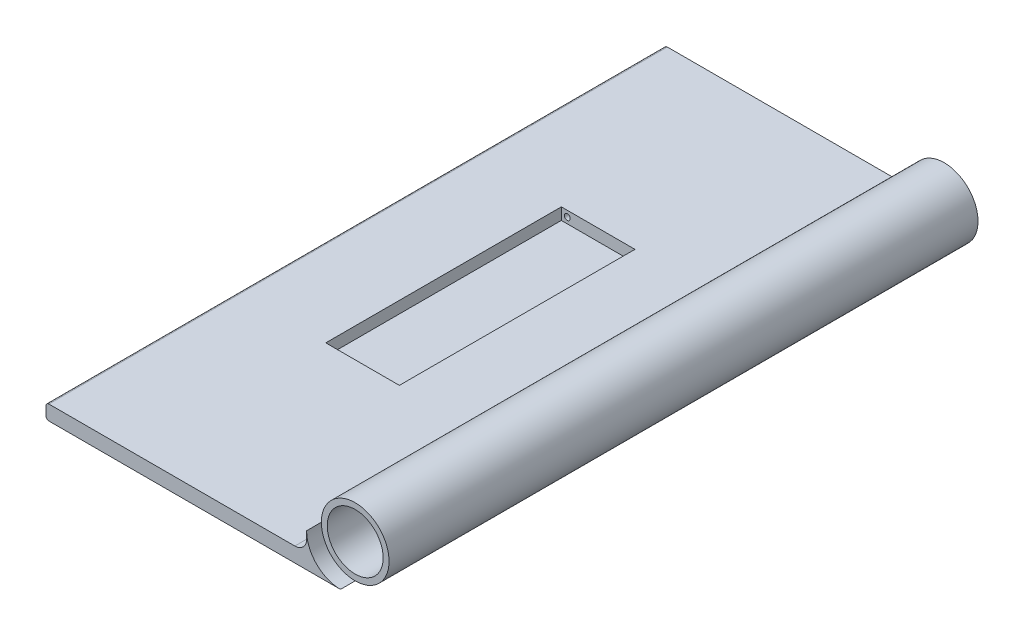
ISO-10303-21;
HEADER;
FILE_DESCRIPTION(('STEP AP214'),'2;1');
FILE_NAME('part.step','',(''),(''),'','','');
FILE_SCHEMA(('AUTOMOTIVE_DESIGN { 1 0 10303 214 1 1 1 1 }'));
ENDSEC;
DATA;
#1=APPLICATION_CONTEXT('core data for automotive mechanical design processes');
#2=APPLICATION_PROTOCOL_DEFINITION('international standard','automotive_design',2000,#1);
#3=PRODUCT_CONTEXT('',#1,'mechanical');
#4=PRODUCT('Part','Part','',(#3));
#5=PRODUCT_RELATED_PRODUCT_CATEGORY('part','',(#4));
#6=PRODUCT_DEFINITION_FORMATION('','',#4);
#7=PRODUCT_DEFINITION_CONTEXT('part definition',#1,'design');
#8=PRODUCT_DEFINITION('design','',#6,#7);
#9=PRODUCT_DEFINITION_SHAPE('','',#8);
#10=(LENGTH_UNIT() NAMED_UNIT(*) SI_UNIT(.MILLI.,.METRE.));
#11=(NAMED_UNIT(*) PLANE_ANGLE_UNIT() SI_UNIT($,.RADIAN.));
#12=(NAMED_UNIT(*) SI_UNIT($,.STERADIAN.) SOLID_ANGLE_UNIT());
#13=UNCERTAINTY_MEASURE_WITH_UNIT(LENGTH_MEASURE(1.E-05),#10,'distance_accuracy_value','');
#14=(GEOMETRIC_REPRESENTATION_CONTEXT(3) GLOBAL_UNCERTAINTY_ASSIGNED_CONTEXT((#13)) GLOBAL_UNIT_ASSIGNED_CONTEXT((#10,
#11,#12)) REPRESENTATION_CONTEXT('',''));
#15=CARTESIAN_POINT('',(0.,0.,0.));
#16=DIRECTION('',(0.,0.,1.));
#17=DIRECTION('',(1.,0.,0.));
#18=AXIS2_PLACEMENT_3D('',#15,#16,#17);
#19=CARTESIAN_POINT('',(0.,0.,200.));
#20=DIRECTION('',(0.,0.,1.));
#21=DIRECTION('',(1.,0.,0.));
#22=AXIS2_PLACEMENT_3D('',#19,#20,#21);
#23=PLANE('',#22);
#24=CARTESIAN_POINT('',(0.,0.,200.));
#25=DIRECTION('',(0.,0.,1.));
#26=DIRECTION('',(1.,0.,0.));
#27=AXIS2_PLACEMENT_3D('',#24,#25,#26);
#28=CIRCLE('',#27,9.5);
#29=CARTESIAN_POINT('',(9.5,0.,200.));
#30=VERTEX_POINT('',#29);
#31=EDGE_CURVE('E236',#30,#30,#28,.T.);
#32=ORIENTED_EDGE('',*,*,#31,.F.);
#33=EDGE_LOOP('',(#32));
#34=FACE_BOUND('',#33,.T.);
#35=CARTESIAN_POINT('',(0.,0.,200.));
#36=DIRECTION('',(0.,0.,1.));
#37=DIRECTION('',(1.,0.,0.));
#38=AXIS2_PLACEMENT_3D('',#35,#36,#37);
#39=CIRCLE('',#38,11.5);
#40=CARTESIAN_POINT('',(0.,-11.5,200.));
#41=VERTEX_POINT('',#40);
#42=CARTESIAN_POINT('',(-11.5,0.,200.));
#43=VERTEX_POINT('',#42);
#44=EDGE_CURVE('E233',#41,#43,#39,.T.);
#45=ORIENTED_EDGE('',*,*,#44,.T.);
#46=CARTESIAN_POINT('',(0.,0.,200.));
#47=DIRECTION('',(0.,0.,1.));
#48=DIRECTION('',(1.,0.,0.));
#49=AXIS2_PLACEMENT_3D('',#46,#47,#48);
#50=CIRCLE('',#49,11.5);
#51=EDGE_CURVE('E226',#43,#41,#50,.T.);
#52=ORIENTED_EDGE('',*,*,#51,.T.);
#53=EDGE_LOOP('',(#45,#52));
#54=FACE_BOUND('',#53,.T.);
#55=ADVANCED_FACE('F33',(#34,#54),#23,.T.);
#56=CARTESIAN_POINT('',(0.,0.,0.));
#57=DIRECTION('',(0.,0.,1.));
#58=DIRECTION('',(1.,0.,0.));
#59=AXIS2_PLACEMENT_3D('',#56,#57,#58);
#60=PLANE('',#59);
#61=CARTESIAN_POINT('',(0.,0.,0.));
#62=DIRECTION('',(0.,0.,1.));
#63=DIRECTION('',(1.,0.,0.));
#64=AXIS2_PLACEMENT_3D('',#61,#62,#63);
#65=CIRCLE('',#64,9.5);
#66=CARTESIAN_POINT('',(9.5,0.,0.));
#67=VERTEX_POINT('',#66);
#68=EDGE_CURVE('E237',#67,#67,#65,.T.);
#69=ORIENTED_EDGE('',*,*,#68,.T.);
#70=EDGE_LOOP('',(#69));
#71=FACE_BOUND('',#70,.T.);
#72=CARTESIAN_POINT('',(0.,0.,0.));
#73=DIRECTION('',(0.,0.,1.));
#74=DIRECTION('',(1.,0.,0.));
#75=AXIS2_PLACEMENT_3D('',#72,#73,#74);
#76=CIRCLE('',#75,11.5);
#77=CARTESIAN_POINT('',(-11.5,0.,0.));
#78=VERTEX_POINT('',#77);
#79=CARTESIAN_POINT('',(0.,-11.5,0.));
#80=VERTEX_POINT('',#79);
#81=EDGE_CURVE('E11',#78,#80,#76,.T.);
#82=ORIENTED_EDGE('',*,*,#81,.F.);
#83=CARTESIAN_POINT('',(0.,0.,0.));
#84=DIRECTION('',(0.,0.,1.));
#85=DIRECTION('',(1.,0.,0.));
#86=AXIS2_PLACEMENT_3D('',#83,#84,#85);
#87=CIRCLE('',#86,11.5);
#88=EDGE_CURVE('E232',#80,#78,#87,.T.);
#89=ORIENTED_EDGE('',*,*,#88,.F.);
#90=EDGE_LOOP('',(#82,#89));
#91=FACE_BOUND('',#90,.T.);
#92=ADVANCED_FACE('F304',(#71,#91),#60,.F.);
#93=CARTESIAN_POINT('',(0.,-6.5,200.));
#94=DIRECTION('',(0.,-1.,0.));
#95=DIRECTION('',(1.,0.,0.));
#96=AXIS2_PLACEMENT_3D('',#93,#94,#95);
#97=PLANE('',#96);
#98=DIRECTION('',(1.,0.,0.));
#99=VECTOR('',#98,1.);
#100=CARTESIAN_POINT('',(-70.,-6.50000000000001,140.));
#101=LINE('',#100,#99);
#102=CARTESIAN_POINT('',(-70.,-6.50000000000001,140.));
#103=VERTEX_POINT('',#102);
#104=CARTESIAN_POINT('',(-45.,-6.50000000000001,140.));
#105=VERTEX_POINT('',#104);
#106=EDGE_CURVE('E166',#103,#105,#101,.T.);
#107=ORIENTED_EDGE('',*,*,#106,.F.);
#108=DIRECTION('',(0.,0.,1.));
#109=VECTOR('',#108,1.);
#110=CARTESIAN_POINT('',(-70.,-6.50000000000001,60.));
#111=LINE('',#110,#109);
#112=CARTESIAN_POINT('',(-70.,-6.50000000000001,60.));
#113=VERTEX_POINT('',#112);
#114=EDGE_CURVE('E49',#113,#103,#111,.T.);
#115=ORIENTED_EDGE('',*,*,#114,.F.);
#116=DIRECTION('',(-1.,0.,0.));
#117=VECTOR('',#116,1.);
#118=CARTESIAN_POINT('',(-70.,-6.50000000000001,60.));
#119=LINE('',#118,#117);
#120=CARTESIAN_POINT('',(-45.,-6.50000000000001,60.));
#121=VERTEX_POINT('',#120);
#122=EDGE_CURVE('E154',#121,#113,#119,.T.);
#123=ORIENTED_EDGE('',*,*,#122,.F.);
#124=DIRECTION('',(0.,0.,-1.));
#125=VECTOR('',#124,1.);
#126=CARTESIAN_POINT('',(-45.,-6.50000000000001,60.));
#127=LINE('',#126,#125);
#128=EDGE_CURVE('E157',#105,#121,#127,.T.);
#129=ORIENTED_EDGE('',*,*,#128,.F.);
#130=EDGE_LOOP('',(#107,#115,#123,#129));
#131=FACE_BOUND('',#130,.T.);
#132=DIRECTION('',(0.,0.,-1.));
#133=VECTOR('',#132,1.);
#134=CARTESIAN_POINT('',(-15.5,-6.5,200.));
#135=LINE('',#134,#133);
#136=CARTESIAN_POINT('',(-15.5,-6.5,205.));
#137=VERTEX_POINT('',#136);
#138=CARTESIAN_POINT('',(-15.5,-6.5,-5.));
#139=VERTEX_POINT('',#138);
#140=EDGE_CURVE('E240',#137,#139,#135,.T.);
#141=ORIENTED_EDGE('',*,*,#140,.T.);
#142=DIRECTION('',(1.,0.,0.));
#143=VECTOR('',#142,1.);
#144=CARTESIAN_POINT('',(0.,-6.5,-5.));
#145=LINE('',#144,#143);
#146=CARTESIAN_POINT('',(-99.,-6.50000000000001,-5.));
#147=VERTEX_POINT('',#146);
#148=EDGE_CURVE('E190',#147,#139,#145,.T.);
#149=ORIENTED_EDGE('',*,*,#148,.F.);
#150=DIRECTION('',(0.,0.,-1.));
#151=VECTOR('',#150,1.);
#152=CARTESIAN_POINT('',(-99.,-6.50000000000001,200.));
#153=LINE('',#152,#151);
#154=CARTESIAN_POINT('',(-99.,-6.50000000000001,205.));
#155=VERTEX_POINT('',#154);
#156=EDGE_CURVE('E42',#155,#147,#153,.T.);
#157=ORIENTED_EDGE('',*,*,#156,.F.);
#158=DIRECTION('',(1.,0.,0.));
#159=VECTOR('',#158,1.);
#160=CARTESIAN_POINT('',(0.,-6.5,205.));
#161=LINE('',#160,#159);
#162=EDGE_CURVE('E213',#155,#137,#161,.T.);
#163=ORIENTED_EDGE('',*,*,#162,.T.);
#164=EDGE_LOOP('',(#141,#149,#157,#163));
#165=FACE_BOUND('',#164,.T.);
#166=ADVANCED_FACE('F35',(#131,#165),#97,.F.);
#167=CARTESIAN_POINT('',(-99.,-7.50000000000001,200.));
#168=DIRECTION('',(0.,0.,-1.));
#169=DIRECTION('',(-1.,0.,0.));
#170=AXIS2_PLACEMENT_3D('',#167,#168,#169);
#171=CYLINDRICAL_SURFACE('',#170,1.);
#172=ORIENTED_EDGE('',*,*,#156,.T.);
#173=CARTESIAN_POINT('',(-99.,-7.50000000000001,-5.));
#174=DIRECTION('',(0.,0.,-1.));
#175=DIRECTION('',(-1.,0.,0.));
#176=AXIS2_PLACEMENT_3D('',#173,#174,#175);
#177=CIRCLE('',#176,1.);
#178=CARTESIAN_POINT('',(-100.,-7.50000000000001,-5.));
#179=VERTEX_POINT('',#178);
#180=EDGE_CURVE('E187',#179,#147,#177,.T.);
#181=ORIENTED_EDGE('',*,*,#180,.F.);
#182=DIRECTION('',(0.,0.,-1.));
#183=VECTOR('',#182,1.);
#184=CARTESIAN_POINT('',(-100.,-7.50000000000002,200.));
#185=LINE('',#184,#183);
#186=CARTESIAN_POINT('',(-100.,-7.50000000000001,205.));
#187=VERTEX_POINT('',#186);
#188=EDGE_CURVE('E256',#187,#179,#185,.T.);
#189=ORIENTED_EDGE('',*,*,#188,.F.);
#190=CARTESIAN_POINT('',(-99.,-7.50000000000001,205.));
#191=DIRECTION('',(0.,0.,-1.));
#192=DIRECTION('',(-1.,0.,0.));
#193=AXIS2_PLACEMENT_3D('',#190,#191,#192);
#194=CIRCLE('',#193,1.);
#195=EDGE_CURVE('E210',#187,#155,#194,.T.);
#196=ORIENTED_EDGE('',*,*,#195,.T.);
#197=EDGE_LOOP('',(#172,#181,#189,#196));
#198=FACE_BOUND('',#197,.T.);
#199=ADVANCED_FACE('F260',(#198),#171,.T.);
#200=CARTESIAN_POINT('',(-100.,0.,200.));
#201=DIRECTION('',(-1.,0.,0.));
#202=DIRECTION('',(0.,0.,1.));
#203=AXIS2_PLACEMENT_3D('',#200,#201,#202);
#204=PLANE('',#203);
#205=ORIENTED_EDGE('',*,*,#188,.T.);
#206=DIRECTION('',(0.,1.,0.));
#207=VECTOR('',#206,1.);
#208=CARTESIAN_POINT('',(-100.,0.,-5.));
#209=LINE('',#208,#207);
#210=CARTESIAN_POINT('',(-100.,-10.5,-5.));
#211=VERTEX_POINT('',#210);
#212=EDGE_CURVE('E184',#211,#179,#209,.T.);
#213=ORIENTED_EDGE('',*,*,#212,.F.);
#214=DIRECTION('',(0.,0.,-1.));
#215=VECTOR('',#214,1.);
#216=CARTESIAN_POINT('',(-100.,-10.5,200.));
#217=LINE('',#216,#215);
#218=CARTESIAN_POINT('',(-100.,-10.5,205.));
#219=VERTEX_POINT('',#218);
#220=EDGE_CURVE('E254',#219,#211,#217,.T.);
#221=ORIENTED_EDGE('',*,*,#220,.F.);
#222=DIRECTION('',(0.,1.,0.));
#223=VECTOR('',#222,1.);
#224=CARTESIAN_POINT('',(-100.,0.,205.));
#225=LINE('',#224,#223);
#226=EDGE_CURVE('E207',#219,#187,#225,.T.);
#227=ORIENTED_EDGE('',*,*,#226,.T.);
#228=EDGE_LOOP('',(#205,#213,#221,#227));
#229=FACE_BOUND('',#228,.T.);
#230=ADVANCED_FACE('F296',(#229),#204,.T.);
#231=CARTESIAN_POINT('',(-99.,-10.5,200.));
#232=DIRECTION('',(0.,0.,-1.));
#233=DIRECTION('',(-1.,0.,0.));
#234=AXIS2_PLACEMENT_3D('',#231,#232,#233);
#235=CYLINDRICAL_SURFACE('',#234,1.);
#236=ORIENTED_EDGE('',*,*,#220,.T.);
#237=CARTESIAN_POINT('',(-99.,-10.5,-5.));
#238=DIRECTION('',(0.,0.,-1.));
#239=DIRECTION('',(-1.,0.,0.));
#240=AXIS2_PLACEMENT_3D('',#237,#238,#239);
#241=CIRCLE('',#240,1.);
#242=CARTESIAN_POINT('',(-99.,-11.5,-5.));
#243=VERTEX_POINT('',#242);
#244=EDGE_CURVE('E181',#243,#211,#241,.T.);
#245=ORIENTED_EDGE('',*,*,#244,.F.);
#246=DIRECTION('',(0.,0.,-1.));
#247=VECTOR('',#246,1.);
#248=CARTESIAN_POINT('',(-99.,-11.5,200.));
#249=LINE('',#248,#247);
#250=CARTESIAN_POINT('',(-99.,-11.5,205.));
#251=VERTEX_POINT('',#250);
#252=EDGE_CURVE('E252',#251,#243,#249,.T.);
#253=ORIENTED_EDGE('',*,*,#252,.F.);
#254=CARTESIAN_POINT('',(-99.,-10.5,205.));
#255=DIRECTION('',(0.,0.,-1.));
#256=DIRECTION('',(-1.,0.,0.));
#257=AXIS2_PLACEMENT_3D('',#254,#255,#256);
#258=CIRCLE('',#257,1.);
#259=EDGE_CURVE('E204',#251,#219,#258,.T.);
#260=ORIENTED_EDGE('',*,*,#259,.T.);
#261=EDGE_LOOP('',(#236,#245,#253,#260));
#262=FACE_BOUND('',#261,.T.);
#263=ADVANCED_FACE('F292',(#262),#235,.T.);
#264=CARTESIAN_POINT('',(0.,-11.5,200.));
#265=DIRECTION('',(0.,-1.,0.));
#266=DIRECTION('',(1.,0.,0.));
#267=AXIS2_PLACEMENT_3D('',#264,#265,#266);
#268=PLANE('',#267);
#269=ORIENTED_EDGE('',*,*,#252,.T.);
#270=DIRECTION('',(-1.,0.,0.));
#271=VECTOR('',#270,1.);
#272=CARTESIAN_POINT('',(0.,-11.5,-5.));
#273=LINE('',#272,#271);
#274=CARTESIAN_POINT('',(0.,-11.5,-5.));
#275=VERTEX_POINT('',#274);
#276=EDGE_CURVE('E178',#275,#243,#273,.T.);
#277=ORIENTED_EDGE('',*,*,#276,.F.);
#278=DIRECTION('',(0.,0.,-1.));
#279=VECTOR('',#278,1.);
#280=CARTESIAN_POINT('',(0.,-11.5,205.));
#281=LINE('',#280,#279);
#282=EDGE_CURVE('E222',#80,#275,#281,.T.);
#283=ORIENTED_EDGE('',*,*,#282,.F.);
#284=DIRECTION('',(0.,0.,-1.));
#285=VECTOR('',#284,1.);
#286=CARTESIAN_POINT('',(0.,-11.5,200.));
#287=LINE('',#286,#285);
#288=EDGE_CURVE('E250',#41,#80,#287,.T.);
#289=ORIENTED_EDGE('',*,*,#288,.F.);
#290=CARTESIAN_POINT('',(0.,-11.5,205.));
#291=VERTEX_POINT('',#290);
#292=EDGE_CURVE('E228',#291,#41,#281,.T.);
#293=ORIENTED_EDGE('',*,*,#292,.F.);
#294=DIRECTION('',(-1.,0.,0.));
#295=VECTOR('',#294,1.);
#296=CARTESIAN_POINT('',(0.,-11.5,205.));
#297=LINE('',#296,#295);
#298=EDGE_CURVE('E201',#291,#251,#297,.T.);
#299=ORIENTED_EDGE('',*,*,#298,.T.);
#300=EDGE_LOOP('',(#269,#277,#283,#289,#293,#299));
#301=FACE_BOUND('',#300,.T.);
#302=ADVANCED_FACE('F289',(#301),#268,.T.);
#303=CARTESIAN_POINT('',(0.,0.,200.));
#304=DIRECTION('',(0.,0.,-1.));
#305=DIRECTION('',(-1.,0.,0.));
#306=AXIS2_PLACEMENT_3D('',#303,#304,#305);
#307=CYLINDRICAL_SURFACE('',#306,11.5);
#308=ORIENTED_EDGE('',*,*,#88,.T.);
#309=DIRECTION('',(0.,0.,-1.));
#310=VECTOR('',#309,1.);
#311=CARTESIAN_POINT('',(-11.5,0.,200.));
#312=LINE('',#311,#310);
#313=EDGE_CURVE('E247',#43,#78,#312,.T.);
#314=ORIENTED_EDGE('',*,*,#313,.F.);
#315=ORIENTED_EDGE('',*,*,#44,.F.);
#316=ORIENTED_EDGE('',*,*,#288,.T.);
#317=EDGE_LOOP('',(#308,#314,#315,#316));
#318=FACE_BOUND('',#317,.T.);
#319=ADVANCED_FACE('F303',(#318),#307,.T.);
#320=CARTESIAN_POINT('',(-11.5,0.,200.));
#321=DIRECTION('',(1.,0.,0.));
#322=DIRECTION('',(0.,0.,-1.));
#323=AXIS2_PLACEMENT_3D('',#320,#321,#322);
#324=PLANE('',#323);
#325=ORIENTED_EDGE('',*,*,#313,.T.);
#326=DIRECTION('',(0.,0.,-1.));
#327=VECTOR('',#326,1.);
#328=CARTESIAN_POINT('',(-11.5,0.,205.));
#329=LINE('',#328,#327);
#330=CARTESIAN_POINT('',(-11.5,0.,-5.));
#331=VERTEX_POINT('',#330);
#332=EDGE_CURVE('E227',#78,#331,#329,.T.);
#333=ORIENTED_EDGE('',*,*,#332,.T.);
#334=DIRECTION('',(0.,1.,0.));
#335=VECTOR('',#334,1.);
#336=CARTESIAN_POINT('',(-11.5,0.,-5.));
#337=LINE('',#336,#335);
#338=CARTESIAN_POINT('',(-11.5,-2.49999999999997,-5.));
#339=VERTEX_POINT('',#338);
#340=EDGE_CURVE('E196',#339,#331,#337,.T.);
#341=ORIENTED_EDGE('',*,*,#340,.F.);
#342=DIRECTION('',(0.,0.,-1.));
#343=VECTOR('',#342,1.);
#344=CARTESIAN_POINT('',(-11.5,-2.49999999999997,200.));
#345=LINE('',#344,#343);
#346=CARTESIAN_POINT('',(-11.5,-2.49999999999997,205.));
#347=VERTEX_POINT('',#346);
#348=EDGE_CURVE('E245',#347,#339,#345,.T.);
#349=ORIENTED_EDGE('',*,*,#348,.F.);
#350=DIRECTION('',(0.,1.,0.));
#351=VECTOR('',#350,1.);
#352=CARTESIAN_POINT('',(-11.5,0.,205.));
#353=LINE('',#352,#351);
#354=CARTESIAN_POINT('',(-11.5,0.,205.));
#355=VERTEX_POINT('',#354);
#356=EDGE_CURVE('E219',#347,#355,#353,.T.);
#357=ORIENTED_EDGE('',*,*,#356,.T.);
#358=EDGE_CURVE('E223',#355,#43,#329,.T.);
#359=ORIENTED_EDGE('',*,*,#358,.T.);
#360=EDGE_LOOP('',(#325,#333,#341,#349,#357,#359));
#361=FACE_BOUND('',#360,.T.);
#362=ADVANCED_FACE('F280',(#361),#324,.F.);
#363=CARTESIAN_POINT('',(-15.5,-2.5,200.));
#364=DIRECTION('',(0.,0.,-1.));
#365=DIRECTION('',(-1.,0.,0.));
#366=AXIS2_PLACEMENT_3D('',#363,#364,#365);
#367=CYLINDRICAL_SURFACE('',#366,4.);
#368=ORIENTED_EDGE('',*,*,#348,.T.);
#369=CARTESIAN_POINT('',(-15.5,-2.5,-5.));
#370=DIRECTION('',(0.,0.,-1.));
#371=DIRECTION('',(-1.,0.,0.));
#372=AXIS2_PLACEMENT_3D('',#369,#370,#371);
#373=CIRCLE('',#372,4.);
#374=EDGE_CURVE('E193',#139,#339,#373,.F.);
#375=ORIENTED_EDGE('',*,*,#374,.F.);
#376=ORIENTED_EDGE('',*,*,#140,.F.);
#377=CARTESIAN_POINT('',(-15.5,-2.5,205.));
#378=DIRECTION('',(0.,0.,-1.));
#379=DIRECTION('',(-1.,0.,0.));
#380=AXIS2_PLACEMENT_3D('',#377,#378,#379);
#381=CIRCLE('',#380,4.);
#382=EDGE_CURVE('E216',#137,#347,#381,.F.);
#383=ORIENTED_EDGE('',*,*,#382,.T.);
#384=EDGE_LOOP('',(#368,#375,#376,#383));
#385=FACE_BOUND('',#384,.T.);
#386=ADVANCED_FACE('F272',(#385),#367,.F.);
#387=CARTESIAN_POINT('',(0.,0.,200.));
#388=DIRECTION('',(0.,0.,-1.));
#389=DIRECTION('',(-1.,0.,0.));
#390=AXIS2_PLACEMENT_3D('',#387,#388,#389);
#391=CYLINDRICAL_SURFACE('',#390,9.5);
#392=ORIENTED_EDGE('',*,*,#31,.T.);
#393=EDGE_LOOP('',(#392));
#394=FACE_BOUND('',#393,.T.);
#395=ORIENTED_EDGE('',*,*,#68,.F.);
#396=EDGE_LOOP('',(#395));
#397=FACE_BOUND('',#396,.T.);
#398=ADVANCED_FACE('F318',(#394,#397),#391,.F.);
#399=CARTESIAN_POINT('',(0.,0.,-5.));
#400=DIRECTION('',(0.,0.,-1.));
#401=DIRECTION('',(-1.,0.,0.));
#402=AXIS2_PLACEMENT_3D('',#399,#400,#401);
#403=PLANE('',#402);
#404=CARTESIAN_POINT('',(0.,0.,-5.));
#405=DIRECTION('',(0.,0.,-1.));
#406=DIRECTION('',(-1.,0.,0.));
#407=AXIS2_PLACEMENT_3D('',#404,#405,#406);
#408=CIRCLE('',#407,11.5);
#409=EDGE_CURVE('E172',#275,#331,#408,.T.);
#410=ORIENTED_EDGE('',*,*,#409,.F.);
#411=ORIENTED_EDGE('',*,*,#276,.T.);
#412=ORIENTED_EDGE('',*,*,#244,.T.);
#413=ORIENTED_EDGE('',*,*,#212,.T.);
#414=ORIENTED_EDGE('',*,*,#180,.T.);
#415=ORIENTED_EDGE('',*,*,#148,.T.);
#416=ORIENTED_EDGE('',*,*,#374,.T.);
#417=ORIENTED_EDGE('',*,*,#340,.T.);
#418=EDGE_LOOP('',(#410,#411,#412,#413,#414,#415,#416,#417));
#419=FACE_BOUND('',#418,.T.);
#420=ADVANCED_FACE('F267',(#419),#403,.T.);
#421=CARTESIAN_POINT('',(0.,0.,205.));
#422=DIRECTION('',(0.,0.,-1.));
#423=DIRECTION('',(-1.,0.,0.));
#424=AXIS2_PLACEMENT_3D('',#421,#422,#423);
#425=CYLINDRICAL_SURFACE('',#424,11.5);
#426=ORIENTED_EDGE('',*,*,#332,.F.);
#427=ORIENTED_EDGE('',*,*,#81,.T.);
#428=ORIENTED_EDGE('',*,*,#282,.T.);
#429=ORIENTED_EDGE('',*,*,#409,.T.);
#430=EDGE_LOOP('',(#426,#427,#428,#429));
#431=FACE_BOUND('',#430,.T.);
#432=ADVANCED_FACE('F284',(#431),#425,.F.);
#433=ORIENTED_EDGE('',*,*,#51,.F.);
#434=ORIENTED_EDGE('',*,*,#358,.F.);
#435=CARTESIAN_POINT('',(0.,0.,205.));
#436=DIRECTION('',(0.,0.,-1.));
#437=DIRECTION('',(-1.,0.,0.));
#438=AXIS2_PLACEMENT_3D('',#435,#436,#437);
#439=CIRCLE('',#438,11.5);
#440=EDGE_CURVE('E199',#291,#355,#439,.T.);
#441=ORIENTED_EDGE('',*,*,#440,.F.);
#442=ORIENTED_EDGE('',*,*,#292,.T.);
#443=EDGE_LOOP('',(#433,#434,#441,#442));
#444=FACE_BOUND('',#443,.T.);
#445=ADVANCED_FACE('F299',(#444),#425,.F.);
#446=CARTESIAN_POINT('',(0.,0.,205.));
#447=DIRECTION('',(0.,0.,-1.));
#448=DIRECTION('',(-1.,0.,0.));
#449=AXIS2_PLACEMENT_3D('',#446,#447,#448);
#450=PLANE('',#449);
#451=ORIENTED_EDGE('',*,*,#440,.T.);
#452=ORIENTED_EDGE('',*,*,#356,.F.);
#453=ORIENTED_EDGE('',*,*,#382,.F.);
#454=ORIENTED_EDGE('',*,*,#162,.F.);
#455=ORIENTED_EDGE('',*,*,#195,.F.);
#456=ORIENTED_EDGE('',*,*,#226,.F.);
#457=ORIENTED_EDGE('',*,*,#259,.F.);
#458=ORIENTED_EDGE('',*,*,#298,.F.);
#459=EDGE_LOOP('',(#451,#452,#453,#454,#455,#456,#457,#458));
#460=FACE_BOUND('',#459,.T.);
#461=ADVANCED_FACE('F275',(#460),#450,.F.);
#462=CARTESIAN_POINT('',(-70.,-10.5,60.));
#463=DIRECTION('',(-1.,0.,0.));
#464=DIRECTION('',(0.,0.,1.));
#465=AXIS2_PLACEMENT_3D('',#462,#463,#464);
#466=PLANE('',#465);
#467=ORIENTED_EDGE('',*,*,#114,.T.);
#468=DIRECTION('',(0.,1.,0.));
#469=VECTOR('',#468,1.);
#470=CARTESIAN_POINT('',(-70.,-10.5,140.));
#471=LINE('',#470,#469);
#472=CARTESIAN_POINT('',(-70.,-10.5,140.));
#473=VERTEX_POINT('',#472);
#474=EDGE_CURVE('E132',#473,#103,#471,.T.);
#475=ORIENTED_EDGE('',*,*,#474,.F.);
#476=DIRECTION('',(0.,0.,1.));
#477=VECTOR('',#476,1.);
#478=CARTESIAN_POINT('',(-70.,-10.5,60.));
#479=LINE('',#478,#477);
#480=CARTESIAN_POINT('',(-70.,-10.5,60.));
#481=VERTEX_POINT('',#480);
#482=EDGE_CURVE('E136',#481,#473,#479,.T.);
#483=ORIENTED_EDGE('',*,*,#482,.F.);
#484=DIRECTION('',(0.,1.,0.));
#485=VECTOR('',#484,1.);
#486=CARTESIAN_POINT('',(-70.,-10.5,60.));
#487=LINE('',#486,#485);
#488=EDGE_CURVE('E170',#481,#113,#487,.T.);
#489=ORIENTED_EDGE('',*,*,#488,.T.);
#490=EDGE_LOOP('',(#467,#475,#483,#489));
#491=FACE_BOUND('',#490,.T.);
#492=ADVANCED_FACE('F134',(#491),#466,.F.);
#493=CARTESIAN_POINT('',(-70.,-10.5,60.));
#494=DIRECTION('',(0.,0.,-1.));
#495=DIRECTION('',(-1.,0.,0.));
#496=AXIS2_PLACEMENT_3D('',#493,#494,#495);
#497=PLANE('',#496);
#498=CARTESIAN_POINT('',(-68.,-8.5,60.));
#499=DIRECTION('',(0.,0.,-1.));
#500=DIRECTION('',(-1.,0.,0.));
#501=AXIS2_PLACEMENT_3D('',#498,#499,#500);
#502=CIRCLE('',#501,0.999999999999998);
#503=CARTESIAN_POINT('',(-69.,-8.5,60.));
#504=VERTEX_POINT('',#503);
#505=EDGE_CURVE('E160',#504,#504,#502,.F.);
#506=ORIENTED_EDGE('',*,*,#505,.F.);
#507=EDGE_LOOP('',(#506));
#508=FACE_BOUND('',#507,.T.);
#509=ORIENTED_EDGE('',*,*,#122,.T.);
#510=ORIENTED_EDGE('',*,*,#488,.F.);
#511=DIRECTION('',(-1.,0.,0.));
#512=VECTOR('',#511,1.);
#513=CARTESIAN_POINT('',(-70.,-10.5,60.));
#514=LINE('',#513,#512);
#515=CARTESIAN_POINT('',(-45.,-10.5,60.));
#516=VERTEX_POINT('',#515);
#517=EDGE_CURVE('E142',#516,#481,#514,.T.);
#518=ORIENTED_EDGE('',*,*,#517,.F.);
#519=DIRECTION('',(0.,1.,0.));
#520=VECTOR('',#519,1.);
#521=CARTESIAN_POINT('',(-45.,-10.5,60.));
#522=LINE('',#521,#520);
#523=EDGE_CURVE('E173',#516,#121,#522,.T.);
#524=ORIENTED_EDGE('',*,*,#523,.T.);
#525=EDGE_LOOP('',(#509,#510,#518,#524));
#526=FACE_BOUND('',#525,.T.);
#527=ADVANCED_FACE('F387',(#508,#526),#497,.F.);
#528=CARTESIAN_POINT('',(-45.,-10.5,60.));
#529=DIRECTION('',(1.,0.,0.));
#530=DIRECTION('',(0.,1.,0.));
#531=AXIS2_PLACEMENT_3D('',#528,#529,#530);
#532=PLANE('',#531);
#533=ORIENTED_EDGE('',*,*,#128,.T.);
#534=ORIENTED_EDGE('',*,*,#523,.F.);
#535=DIRECTION('',(0.,0.,-1.));
#536=VECTOR('',#535,1.);
#537=CARTESIAN_POINT('',(-45.,-10.5,60.));
#538=LINE('',#537,#536);
#539=CARTESIAN_POINT('',(-45.,-10.5,140.));
#540=VERTEX_POINT('',#539);
#541=EDGE_CURVE('E150',#540,#516,#538,.T.);
#542=ORIENTED_EDGE('',*,*,#541,.F.);
#543=DIRECTION('',(0.,1.,0.));
#544=VECTOR('',#543,1.);
#545=CARTESIAN_POINT('',(-45.,-10.5,140.));
#546=LINE('',#545,#544);
#547=EDGE_CURVE('E141',#540,#105,#546,.T.);
#548=ORIENTED_EDGE('',*,*,#547,.T.);
#549=EDGE_LOOP('',(#533,#534,#542,#548));
#550=FACE_BOUND('',#549,.T.);
#551=ADVANCED_FACE('F395',(#550),#532,.F.);
#552=CARTESIAN_POINT('',(-70.,-10.5,140.));
#553=DIRECTION('',(0.,0.,1.));
#554=DIRECTION('',(1.,0.,0.));
#555=AXIS2_PLACEMENT_3D('',#552,#553,#554);
#556=PLANE('',#555);
#557=CARTESIAN_POINT('',(-68.,-8.5,140.));
#558=DIRECTION('',(0.,0.,1.));
#559=DIRECTION('',(1.,0.,0.));
#560=AXIS2_PLACEMENT_3D('',#557,#558,#559);
#561=CIRCLE('',#560,0.999999999999998);
#562=CARTESIAN_POINT('',(-67.,-8.5,140.));
#563=VERTEX_POINT('',#562);
#564=EDGE_CURVE('E37',#563,#563,#561,.F.);
#565=ORIENTED_EDGE('',*,*,#564,.F.);
#566=EDGE_LOOP('',(#565));
#567=FACE_BOUND('',#566,.T.);
#568=ORIENTED_EDGE('',*,*,#106,.T.);
#569=ORIENTED_EDGE('',*,*,#547,.F.);
#570=DIRECTION('',(1.,0.,0.));
#571=VECTOR('',#570,1.);
#572=CARTESIAN_POINT('',(-70.,-10.5,140.));
#573=LINE('',#572,#571);
#574=EDGE_CURVE('E145',#473,#540,#573,.T.);
#575=ORIENTED_EDGE('',*,*,#574,.F.);
#576=ORIENTED_EDGE('',*,*,#474,.T.);
#577=EDGE_LOOP('',(#568,#569,#575,#576));
#578=FACE_BOUND('',#577,.T.);
#579=ADVANCED_FACE('F146',(#567,#578),#556,.F.);
#580=CARTESIAN_POINT('',(0.,-10.5,0.));
#581=DIRECTION('',(0.,1.,0.));
#582=DIRECTION('',(-1.,0.,0.));
#583=AXIS2_PLACEMENT_3D('',#580,#581,#582);
#584=PLANE('',#583);
#585=ORIENTED_EDGE('',*,*,#482,.T.);
#586=ORIENTED_EDGE('',*,*,#574,.T.);
#587=ORIENTED_EDGE('',*,*,#541,.T.);
#588=ORIENTED_EDGE('',*,*,#517,.T.);
#589=EDGE_LOOP('',(#585,#586,#587,#588));
#590=FACE_BOUND('',#589,.T.);
#591=ADVANCED_FACE('F152',(#590),#584,.T.);
#592=CARTESIAN_POINT('',(-68.,-8.5,141.));
#593=DIRECTION('',(0.,0.,1.));
#594=DIRECTION('',(1.,0.,0.));
#595=AXIS2_PLACEMENT_3D('',#592,#593,#594);
#596=PLANE('',#595);
#597=CARTESIAN_POINT('',(-68.,-8.5,141.));
#598=DIRECTION('',(0.,0.,1.));
#599=DIRECTION('',(1.,0.,0.));
#600=AXIS2_PLACEMENT_3D('',#597,#598,#599);
#601=CIRCLE('',#600,0.999999999999998);
#602=CARTESIAN_POINT('',(-67.,-8.5,141.));
#603=VERTEX_POINT('',#602);
#604=EDGE_CURVE('E561',#603,#603,#601,.T.);
#605=ORIENTED_EDGE('',*,*,#604,.F.);
#606=EDGE_LOOP('',(#605));
#607=FACE_BOUND('',#606,.T.);
#608=ADVANCED_FACE('F417',(#607),#596,.F.);
#609=CARTESIAN_POINT('',(-68.,-8.5,141.));
#610=DIRECTION('',(0.,0.,-1.));
#611=DIRECTION('',(-1.,0.,0.));
#612=AXIS2_PLACEMENT_3D('',#609,#610,#611);
#613=CYLINDRICAL_SURFACE('',#612,0.999999999999998);
#614=ORIENTED_EDGE('',*,*,#604,.T.);
#615=EDGE_LOOP('',(#614));
#616=FACE_BOUND('',#615,.T.);
#617=ORIENTED_EDGE('',*,*,#564,.T.);
#618=EDGE_LOOP('',(#617));
#619=FACE_BOUND('',#618,.T.);
#620=ADVANCED_FACE('F423',(#616,#619),#613,.F.);
#621=CARTESIAN_POINT('',(-68.,-8.5,56.));
#622=DIRECTION('',(0.,0.,1.));
#623=DIRECTION('',(1.,0.,0.));
#624=AXIS2_PLACEMENT_3D('',#621,#622,#623);
#625=CIRCLE('',#624,0.999999999999998);
#626=CARTESIAN_POINT('',(-67.,-8.5,56.));
#627=VERTEX_POINT('',#626);
#628=EDGE_CURVE('E560',#627,#627,#625,.T.);
#629=ORIENTED_EDGE('',*,*,#628,.F.);
#630=EDGE_LOOP('',(#629));
#631=FACE_BOUND('',#630,.T.);
#632=ORIENTED_EDGE('',*,*,#505,.T.);
#633=EDGE_LOOP('',(#632));
#634=FACE_BOUND('',#633,.T.);
#635=ADVANCED_FACE('F431',(#631,#634),#613,.F.);
#636=CARTESIAN_POINT('',(-68.,-8.5,56.));
#637=DIRECTION('',(0.,0.,1.));
#638=DIRECTION('',(1.,0.,0.));
#639=AXIS2_PLACEMENT_3D('',#636,#637,#638);
#640=PLANE('',#639);
#641=ORIENTED_EDGE('',*,*,#628,.T.);
#642=EDGE_LOOP('',(#641));
#643=FACE_BOUND('',#642,.T.);
#644=ADVANCED_FACE('F439',(#643),#640,.T.);
#645=CLOSED_SHELL('',(#55,#92,#166,#199,#230,#263,#302,#319,#362,#386,#398,#420,#432,#445,#461,
#492,#527,#551,#579,#591,#608,#620,#635,#644));
#646=MANIFOLD_SOLID_BREP('B2',#645);
#647=ADVANCED_BREP_SHAPE_REPRESENTATION('',(#18,#646),#14);
#648=SHAPE_DEFINITION_REPRESENTATION(#9,#647);
ENDSEC;
END-ISO-10303-21;
